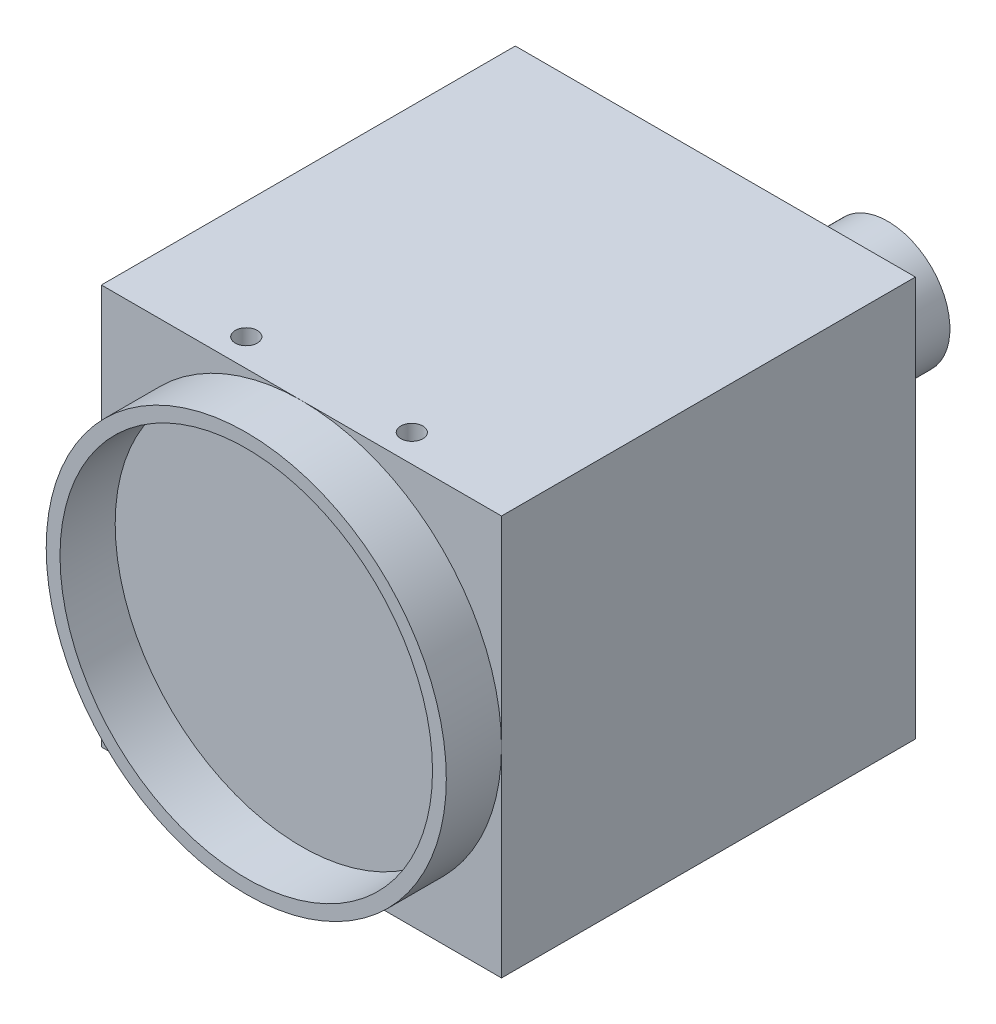
ISO-10303-21;
HEADER;
FILE_DESCRIPTION(('STEP AP214'),'2;1');
FILE_NAME('part.step','',(''),(''),'','','');
FILE_SCHEMA(('AUTOMOTIVE_DESIGN { 1 0 10303 214 1 1 1 1 }'));
ENDSEC;
DATA;
#1=APPLICATION_CONTEXT('core data for automotive mechanical design processes');
#2=APPLICATION_PROTOCOL_DEFINITION('international standard','automotive_design',2000,#1);
#3=PRODUCT_CONTEXT('',#1,'mechanical');
#4=PRODUCT('Part','Part','',(#3));
#5=PRODUCT_RELATED_PRODUCT_CATEGORY('part','',(#4));
#6=PRODUCT_DEFINITION_FORMATION('','',#4);
#7=PRODUCT_DEFINITION_CONTEXT('part definition',#1,'design');
#8=PRODUCT_DEFINITION('design','',#6,#7);
#9=PRODUCT_DEFINITION_SHAPE('','',#8);
#10=(LENGTH_UNIT() NAMED_UNIT(*) SI_UNIT(.MILLI.,.METRE.));
#11=(NAMED_UNIT(*) PLANE_ANGLE_UNIT() SI_UNIT($,.RADIAN.));
#12=(NAMED_UNIT(*) SI_UNIT($,.STERADIAN.) SOLID_ANGLE_UNIT());
#13=UNCERTAINTY_MEASURE_WITH_UNIT(LENGTH_MEASURE(1.E-05),#10,'distance_accuracy_value','');
#14=(GEOMETRIC_REPRESENTATION_CONTEXT(3) GLOBAL_UNCERTAINTY_ASSIGNED_CONTEXT((#13)) GLOBAL_UNIT_ASSIGNED_CONTEXT((#10,
#11,#12)) REPRESENTATION_CONTEXT('',''));
#15=CARTESIAN_POINT('',(0.,0.,0.));
#16=DIRECTION('',(0.,0.,1.));
#17=DIRECTION('',(1.,0.,0.));
#18=AXIS2_PLACEMENT_3D('',#15,#16,#17);
#19=CARTESIAN_POINT('',(0.,0.,30.));
#20=DIRECTION('',(0.,0.,-1.));
#21=DIRECTION('',(-1.,0.,0.));
#22=AXIS2_PLACEMENT_3D('',#19,#20,#21);
#23=PLANE('',#22);
#24=CARTESIAN_POINT('',(0.,0.,30.));
#25=DIRECTION('',(0.,0.,1.));
#26=DIRECTION('',(1.,0.,0.));
#27=AXIS2_PLACEMENT_3D('',#24,#25,#26);
#28=CIRCLE('',#27,14.5);
#29=CARTESIAN_POINT('',(14.5,0.,30.));
#30=VERTEX_POINT('',#29);
#31=CARTESIAN_POINT('',(0.,14.5,30.));
#32=VERTEX_POINT('',#31);
#33=EDGE_CURVE('E45',#30,#32,#28,.T.);
#34=ORIENTED_EDGE('',*,*,#33,.F.);
#35=DIRECTION('',(0.,1.,0.));
#36=VECTOR('',#35,1.);
#37=CARTESIAN_POINT('',(14.5,-14.5,30.));
#38=LINE('',#37,#36);
#39=CARTESIAN_POINT('',(14.5,14.5,30.));
#40=VERTEX_POINT('',#39);
#41=EDGE_CURVE('E147',#30,#40,#38,.T.);
#42=ORIENTED_EDGE('',*,*,#41,.T.);
#43=DIRECTION('',(-1.,0.,0.));
#44=VECTOR('',#43,1.);
#45=CARTESIAN_POINT('',(-14.5,14.5,30.));
#46=LINE('',#45,#44);
#47=EDGE_CURVE('E158',#40,#32,#46,.T.);
#48=ORIENTED_EDGE('',*,*,#47,.T.);
#49=EDGE_LOOP('',(#34,#42,#48));
#50=FACE_BOUND('',#49,.T.);
#51=ADVANCED_FACE('F34',(#50),#23,.F.);
#52=CARTESIAN_POINT('',(-14.5,0.,30.));
#53=VERTEX_POINT('',#52);
#54=EDGE_CURVE('E11',#32,#53,#28,.T.);
#55=ORIENTED_EDGE('',*,*,#54,.F.);
#56=CARTESIAN_POINT('',(-14.5,14.5,30.));
#57=VERTEX_POINT('',#56);
#58=EDGE_CURVE('E146',#32,#57,#46,.T.);
#59=ORIENTED_EDGE('',*,*,#58,.T.);
#60=DIRECTION('',(0.,-1.,0.));
#61=VECTOR('',#60,1.);
#62=CARTESIAN_POINT('',(-14.5,-14.5,30.));
#63=LINE('',#62,#61);
#64=EDGE_CURVE('E274',#57,#53,#63,.T.);
#65=ORIENTED_EDGE('',*,*,#64,.T.);
#66=EDGE_LOOP('',(#55,#59,#65));
#67=FACE_BOUND('',#66,.T.);
#68=ADVANCED_FACE('F306',(#67),#23,.F.);
#69=CARTESIAN_POINT('',(0.,-14.5,30.));
#70=VERTEX_POINT('',#69);
#71=EDGE_CURVE('E43',#53,#70,#28,.T.);
#72=ORIENTED_EDGE('',*,*,#71,.F.);
#73=CARTESIAN_POINT('',(-14.5,-14.5,30.));
#74=VERTEX_POINT('',#73);
#75=EDGE_CURVE('E273',#53,#74,#63,.T.);
#76=ORIENTED_EDGE('',*,*,#75,.T.);
#77=DIRECTION('',(1.,0.,0.));
#78=VECTOR('',#77,1.);
#79=CARTESIAN_POINT('',(-14.5,-14.5,30.));
#80=LINE('',#79,#78);
#81=EDGE_CURVE('E277',#74,#70,#80,.T.);
#82=ORIENTED_EDGE('',*,*,#81,.T.);
#83=EDGE_LOOP('',(#72,#76,#82));
#84=FACE_BOUND('',#83,.T.);
#85=ADVANCED_FACE('F315',(#84),#23,.F.);
#86=CARTESIAN_POINT('',(14.5,-14.5,30.));
#87=DIRECTION('',(-1.,0.,0.));
#88=DIRECTION('',(0.,0.,1.));
#89=AXIS2_PLACEMENT_3D('',#86,#87,#88);
#90=PLANE('',#89);
#91=DIRECTION('',(0.,1.,0.));
#92=VECTOR('',#91,1.);
#93=CARTESIAN_POINT('',(14.5,-14.5,0.));
#94=LINE('',#93,#92);
#95=CARTESIAN_POINT('',(14.5,-14.5,0.));
#96=VERTEX_POINT('',#95);
#97=CARTESIAN_POINT('',(14.5,14.5,0.));
#98=VERTEX_POINT('',#97);
#99=EDGE_CURVE('E270',#96,#98,#94,.T.);
#100=ORIENTED_EDGE('',*,*,#99,.T.);
#101=DIRECTION('',(0.,0.,-1.));
#102=VECTOR('',#101,1.);
#103=CARTESIAN_POINT('',(14.5,14.5,30.));
#104=LINE('',#103,#102);
#105=EDGE_CURVE('E38',#40,#98,#104,.T.);
#106=ORIENTED_EDGE('',*,*,#105,.F.);
#107=ORIENTED_EDGE('',*,*,#41,.F.);
#108=CARTESIAN_POINT('',(14.5,-14.5,30.));
#109=VERTEX_POINT('',#108);
#110=EDGE_CURVE('E139',#109,#30,#38,.T.);
#111=ORIENTED_EDGE('',*,*,#110,.F.);
#112=DIRECTION('',(0.,0.,-1.));
#113=VECTOR('',#112,1.);
#114=CARTESIAN_POINT('',(14.5,-14.5,30.));
#115=LINE('',#114,#113);
#116=EDGE_CURVE('E279',#109,#96,#115,.T.);
#117=ORIENTED_EDGE('',*,*,#116,.T.);
#118=EDGE_LOOP('',(#100,#106,#107,#111,#117));
#119=FACE_BOUND('',#118,.T.);
#120=ADVANCED_FACE('F36',(#119),#90,.F.);
#121=CARTESIAN_POINT('',(-14.5,14.5,30.));
#122=DIRECTION('',(0.,-1.,0.));
#123=DIRECTION('',(0.,0.,-1.));
#124=AXIS2_PLACEMENT_3D('',#121,#122,#123);
#125=PLANE('',#124);
#126=CARTESIAN_POINT('',(-5.99999999999999,14.5,28.));
#127=DIRECTION('',(0.,1.,0.));
#128=DIRECTION('',(0.,0.,1.));
#129=AXIS2_PLACEMENT_3D('',#126,#127,#128);
#130=CIRCLE('',#129,0.799999999999999);
#131=CARTESIAN_POINT('',(-5.99999999999999,14.5,28.8));
#132=VERTEX_POINT('',#131);
#133=EDGE_CURVE('E259',#132,#132,#130,.T.);
#134=ORIENTED_EDGE('',*,*,#133,.F.);
#135=EDGE_LOOP('',(#134));
#136=FACE_BOUND('',#135,.T.);
#137=CARTESIAN_POINT('',(5.99999999999999,14.5,28.));
#138=DIRECTION('',(0.,1.,0.));
#139=DIRECTION('',(0.,0.,1.));
#140=AXIS2_PLACEMENT_3D('',#137,#138,#139);
#141=CIRCLE('',#140,0.799999999999999);
#142=CARTESIAN_POINT('',(5.99999999999999,14.5,28.8));
#143=VERTEX_POINT('',#142);
#144=EDGE_CURVE('E265',#143,#143,#141,.T.);
#145=ORIENTED_EDGE('',*,*,#144,.F.);
#146=EDGE_LOOP('',(#145));
#147=FACE_BOUND('',#146,.T.);
#148=DIRECTION('',(-1.,0.,0.));
#149=VECTOR('',#148,1.);
#150=CARTESIAN_POINT('',(-14.5,14.5,0.));
#151=LINE('',#150,#149);
#152=CARTESIAN_POINT('',(-14.5,14.5,0.));
#153=VERTEX_POINT('',#152);
#154=EDGE_CURVE('E281',#98,#153,#151,.T.);
#155=ORIENTED_EDGE('',*,*,#154,.T.);
#156=DIRECTION('',(0.,0.,-1.));
#157=VECTOR('',#156,1.);
#158=CARTESIAN_POINT('',(-14.5,14.5,30.));
#159=LINE('',#158,#157);
#160=EDGE_CURVE('E163',#57,#153,#159,.T.);
#161=ORIENTED_EDGE('',*,*,#160,.F.);
#162=ORIENTED_EDGE('',*,*,#58,.F.);
#163=ORIENTED_EDGE('',*,*,#47,.F.);
#164=ORIENTED_EDGE('',*,*,#105,.T.);
#165=EDGE_LOOP('',(#155,#161,#162,#163,#164));
#166=FACE_BOUND('',#165,.T.);
#167=ADVANCED_FACE('F307',(#136,#147,#166),#125,.F.);
#168=CARTESIAN_POINT('',(-14.5,-14.5,30.));
#169=DIRECTION('',(1.,0.,0.));
#170=DIRECTION('',(0.,0.,-1.));
#171=AXIS2_PLACEMENT_3D('',#168,#169,#170);
#172=PLANE('',#171);
#173=DIRECTION('',(0.,-1.,0.));
#174=VECTOR('',#173,1.);
#175=CARTESIAN_POINT('',(-14.5,-14.5,0.));
#176=LINE('',#175,#174);
#177=CARTESIAN_POINT('',(-14.5,-14.5,0.));
#178=VERTEX_POINT('',#177);
#179=EDGE_CURVE('E283',#153,#178,#176,.T.);
#180=ORIENTED_EDGE('',*,*,#179,.T.);
#181=DIRECTION('',(0.,0.,-1.));
#182=VECTOR('',#181,1.);
#183=CARTESIAN_POINT('',(-14.5,-14.5,30.));
#184=LINE('',#183,#182);
#185=EDGE_CURVE('E287',#74,#178,#184,.T.);
#186=ORIENTED_EDGE('',*,*,#185,.F.);
#187=ORIENTED_EDGE('',*,*,#75,.F.);
#188=ORIENTED_EDGE('',*,*,#64,.F.);
#189=ORIENTED_EDGE('',*,*,#160,.T.);
#190=EDGE_LOOP('',(#180,#186,#187,#188,#189));
#191=FACE_BOUND('',#190,.T.);
#192=ADVANCED_FACE('F294',(#191),#172,.F.);
#193=CARTESIAN_POINT('',(-14.5,-14.5,30.));
#194=DIRECTION('',(0.,1.,0.));
#195=DIRECTION('',(0.,0.,1.));
#196=AXIS2_PLACEMENT_3D('',#193,#194,#195);
#197=PLANE('',#196);
#198=CARTESIAN_POINT('',(6.,-14.5,3.3));
#199=DIRECTION('',(0.,-1.,0.));
#200=DIRECTION('',(0.,0.,-1.));
#201=AXIS2_PLACEMENT_3D('',#198,#199,#200);
#202=CIRCLE('',#201,0.79999999999999);
#203=CARTESIAN_POINT('',(6.,-14.5,2.50000000000001));
#204=VERTEX_POINT('',#203);
#205=EDGE_CURVE('E211',#204,#204,#202,.T.);
#206=ORIENTED_EDGE('',*,*,#205,.F.);
#207=EDGE_LOOP('',(#206));
#208=FACE_BOUND('',#207,.T.);
#209=CARTESIAN_POINT('',(-6.,-14.5,3.3));
#210=DIRECTION('',(0.,-1.,0.));
#211=DIRECTION('',(0.,0.,-1.));
#212=AXIS2_PLACEMENT_3D('',#209,#210,#211);
#213=CIRCLE('',#212,0.79999999999999);
#214=CARTESIAN_POINT('',(-6.,-14.5,2.50000000000001));
#215=VERTEX_POINT('',#214);
#216=EDGE_CURVE('E223',#215,#215,#213,.T.);
#217=ORIENTED_EDGE('',*,*,#216,.F.);
#218=EDGE_LOOP('',(#217));
#219=FACE_BOUND('',#218,.T.);
#220=CARTESIAN_POINT('',(5.99999999999999,-14.5,25.5));
#221=DIRECTION('',(0.,-1.,0.));
#222=DIRECTION('',(0.,0.,-1.));
#223=AXIS2_PLACEMENT_3D('',#220,#221,#222);
#224=CIRCLE('',#223,0.799999999999999);
#225=CARTESIAN_POINT('',(5.99999999999999,-14.5,24.7));
#226=VERTEX_POINT('',#225);
#227=EDGE_CURVE('E229',#226,#226,#224,.T.);
#228=ORIENTED_EDGE('',*,*,#227,.F.);
#229=EDGE_LOOP('',(#228));
#230=FACE_BOUND('',#229,.T.);
#231=CARTESIAN_POINT('',(-5.99999999999999,-14.5,25.5));
#232=DIRECTION('',(0.,-1.,0.));
#233=DIRECTION('',(0.,0.,-1.));
#234=AXIS2_PLACEMENT_3D('',#231,#232,#233);
#235=CIRCLE('',#234,0.799999999999999);
#236=CARTESIAN_POINT('',(-5.99999999999999,-14.5,24.7));
#237=VERTEX_POINT('',#236);
#238=EDGE_CURVE('E235',#237,#237,#235,.T.);
#239=ORIENTED_EDGE('',*,*,#238,.F.);
#240=EDGE_LOOP('',(#239));
#241=FACE_BOUND('',#240,.T.);
#242=CARTESIAN_POINT('',(0.,-14.5,3.3));
#243=DIRECTION('',(0.,-1.,0.));
#244=DIRECTION('',(0.,0.,-1.));
#245=AXIS2_PLACEMENT_3D('',#242,#243,#244);
#246=CIRCLE('',#245,1.24999999999999);
#247=CARTESIAN_POINT('',(0.,-14.5,2.05000000000001));
#248=VERTEX_POINT('',#247);
#249=EDGE_CURVE('E241',#248,#248,#246,.T.);
#250=ORIENTED_EDGE('',*,*,#249,.F.);
#251=EDGE_LOOP('',(#250));
#252=FACE_BOUND('',#251,.T.);
#253=CARTESIAN_POINT('',(10.,-14.5,27.));
#254=DIRECTION('',(0.,-1.,0.));
#255=DIRECTION('',(0.,0.,-1.));
#256=AXIS2_PLACEMENT_3D('',#253,#254,#255);
#257=CIRCLE('',#256,1.25);
#258=CARTESIAN_POINT('',(10.,-14.5,25.75));
#259=VERTEX_POINT('',#258);
#260=EDGE_CURVE('E247',#259,#259,#257,.T.);
#261=ORIENTED_EDGE('',*,*,#260,.F.);
#262=EDGE_LOOP('',(#261));
#263=FACE_BOUND('',#262,.T.);
#264=CARTESIAN_POINT('',(-10.,-14.5,27.));
#265=DIRECTION('',(0.,-1.,0.));
#266=DIRECTION('',(0.,0.,-1.));
#267=AXIS2_PLACEMENT_3D('',#264,#265,#266);
#268=CIRCLE('',#267,1.25);
#269=CARTESIAN_POINT('',(-10.,-14.5,25.75));
#270=VERTEX_POINT('',#269);
#271=EDGE_CURVE('E253',#270,#270,#268,.T.);
#272=ORIENTED_EDGE('',*,*,#271,.F.);
#273=EDGE_LOOP('',(#272));
#274=FACE_BOUND('',#273,.T.);
#275=DIRECTION('',(1.,0.,0.));
#276=VECTOR('',#275,1.);
#277=CARTESIAN_POINT('',(-14.5,-14.5,0.));
#278=LINE('',#277,#276);
#279=EDGE_CURVE('E156',#178,#96,#278,.T.);
#280=ORIENTED_EDGE('',*,*,#279,.T.);
#281=ORIENTED_EDGE('',*,*,#116,.F.);
#282=EDGE_CURVE('E142',#70,#109,#80,.T.);
#283=ORIENTED_EDGE('',*,*,#282,.F.);
#284=ORIENTED_EDGE('',*,*,#81,.F.);
#285=ORIENTED_EDGE('',*,*,#185,.T.);
#286=EDGE_LOOP('',(#280,#281,#283,#284,#285));
#287=FACE_BOUND('',#286,.T.);
#288=ADVANCED_FACE('F303',(#208,#219,#230,#241,#252,#263,#274,#287),#197,.F.);
#289=EDGE_CURVE('E52',#70,#30,#28,.T.);
#290=ORIENTED_EDGE('',*,*,#289,.F.);
#291=ORIENTED_EDGE('',*,*,#282,.T.);
#292=ORIENTED_EDGE('',*,*,#110,.T.);
#293=EDGE_LOOP('',(#290,#291,#292));
#294=FACE_BOUND('',#293,.T.);
#295=ADVANCED_FACE('F141',(#294),#23,.F.);
#296=CARTESIAN_POINT('',(0.,0.,0.));
#297=DIRECTION('',(0.,0.,-1.));
#298=DIRECTION('',(-1.,0.,0.));
#299=AXIS2_PLACEMENT_3D('',#296,#297,#298);
#300=PLANE('',#299);
#301=CARTESIAN_POINT('',(8.50000000000001,8.5,0.));
#302=DIRECTION('',(0.,0.,-1.));
#303=DIRECTION('',(-1.,0.,0.));
#304=AXIS2_PLACEMENT_3D('',#301,#302,#303);
#305=CIRCLE('',#304,4.5);
#306=CARTESIAN_POINT('',(4.00000000000001,8.5,0.));
#307=VERTEX_POINT('',#306);
#308=EDGE_CURVE('E171',#307,#307,#305,.T.);
#309=ORIENTED_EDGE('',*,*,#308,.F.);
#310=EDGE_LOOP('',(#309));
#311=FACE_BOUND('',#310,.T.);
#312=CARTESIAN_POINT('',(-6.5,-10.0002765308904,0.));
#313=DIRECTION('',(0.,0.,-1.));
#314=DIRECTION('',(-1.,0.,0.));
#315=AXIS2_PLACEMENT_3D('',#312,#313,#314);
#316=CIRCLE('',#315,1.00027653089044);
#317=CARTESIAN_POINT('',(-7.50027653089044,-10.0002765308904,0.));
#318=VERTEX_POINT('',#317);
#319=EDGE_CURVE('E178',#318,#318,#316,.T.);
#320=ORIENTED_EDGE('',*,*,#319,.F.);
#321=EDGE_LOOP('',(#320));
#322=FACE_BOUND('',#321,.T.);
#323=CARTESIAN_POINT('',(6.5,-10.,0.));
#324=DIRECTION('',(0.,0.,-1.));
#325=DIRECTION('',(-1.,0.,0.));
#326=AXIS2_PLACEMENT_3D('',#323,#324,#325);
#327=CIRCLE('',#326,1.);
#328=CARTESIAN_POINT('',(5.5,-10.,0.));
#329=VERTEX_POINT('',#328);
#330=EDGE_CURVE('E170',#329,#329,#327,.T.);
#331=ORIENTED_EDGE('',*,*,#330,.F.);
#332=EDGE_LOOP('',(#331));
#333=FACE_BOUND('',#332,.T.);
#334=DIRECTION('',(0.,1.,0.));
#335=VECTOR('',#334,1.);
#336=CARTESIAN_POINT('',(-5.,-11.,0.));
#337=LINE('',#336,#335);
#338=CARTESIAN_POINT('',(-5.,-11.,0.));
#339=VERTEX_POINT('',#338);
#340=CARTESIAN_POINT('',(-5.,-9.,0.));
#341=VERTEX_POINT('',#340);
#342=EDGE_CURVE('E177',#339,#341,#337,.T.);
#343=ORIENTED_EDGE('',*,*,#342,.F.);
#344=DIRECTION('',(-1.,0.,0.));
#345=VECTOR('',#344,1.);
#346=CARTESIAN_POINT('',(5.,-11.,0.));
#347=LINE('',#346,#345);
#348=CARTESIAN_POINT('',(5.,-11.,0.));
#349=VERTEX_POINT('',#348);
#350=EDGE_CURVE('E190',#349,#339,#347,.T.);
#351=ORIENTED_EDGE('',*,*,#350,.F.);
#352=DIRECTION('',(0.,-1.,0.));
#353=VECTOR('',#352,1.);
#354=CARTESIAN_POINT('',(5.,-11.,0.));
#355=LINE('',#354,#353);
#356=CARTESIAN_POINT('',(5.,-9.,0.));
#357=VERTEX_POINT('',#356);
#358=EDGE_CURVE('E204',#357,#349,#355,.T.);
#359=ORIENTED_EDGE('',*,*,#358,.F.);
#360=DIRECTION('',(1.,0.,0.));
#361=VECTOR('',#360,1.);
#362=CARTESIAN_POINT('',(5.,-9.,0.));
#363=LINE('',#362,#361);
#364=EDGE_CURVE('E201',#341,#357,#363,.T.);
#365=ORIENTED_EDGE('',*,*,#364,.F.);
#366=EDGE_LOOP('',(#343,#351,#359,#365));
#367=FACE_BOUND('',#366,.T.);
#368=ORIENTED_EDGE('',*,*,#99,.F.);
#369=ORIENTED_EDGE('',*,*,#279,.F.);
#370=ORIENTED_EDGE('',*,*,#179,.F.);
#371=ORIENTED_EDGE('',*,*,#154,.F.);
#372=EDGE_LOOP('',(#368,#369,#370,#371));
#373=FACE_BOUND('',#372,.T.);
#374=ADVANCED_FACE('F301',(#311,#322,#333,#367,#373),#300,.T.);
#375=CARTESIAN_POINT('',(5.99999999999999,12.,28.));
#376=DIRECTION('',(0.,1.,0.));
#377=DIRECTION('',(0.,0.,1.));
#378=AXIS2_PLACEMENT_3D('',#375,#376,#377);
#379=CONICAL_SURFACE('',#378,0.799999999999999,1.02974425867665);
#380=CARTESIAN_POINT('',(5.99999999999999,11.519311504778,28.));
#381=VERTEX_POINT('',#380);
#382=VERTEX_LOOP('',#381);
#383=FACE_BOUND('',#382,.T.);
#384=CARTESIAN_POINT('',(5.99999999999999,12.,28.));
#385=DIRECTION('',(0.,1.,0.));
#386=DIRECTION('',(0.,0.,1.));
#387=AXIS2_PLACEMENT_3D('',#384,#385,#386);
#388=CIRCLE('',#387,0.799999999999999);
#389=CARTESIAN_POINT('',(5.99999999999999,12.,28.8));
#390=VERTEX_POINT('',#389);
#391=EDGE_CURVE('E268',#390,#390,#388,.T.);
#392=ORIENTED_EDGE('',*,*,#391,.T.);
#393=EDGE_LOOP('',(#392));
#394=FACE_BOUND('',#393,.T.);
#395=ADVANCED_FACE('F331',(#383,#394),#379,.F.);
#396=CARTESIAN_POINT('',(5.99999999999999,14.5,28.));
#397=DIRECTION('',(0.,1.,0.));
#398=DIRECTION('',(0.,0.,1.));
#399=AXIS2_PLACEMENT_3D('',#396,#397,#398);
#400=CYLINDRICAL_SURFACE('',#399,0.799999999999999);
#401=ORIENTED_EDGE('',*,*,#391,.F.);
#402=EDGE_LOOP('',(#401));
#403=FACE_BOUND('',#402,.T.);
#404=ORIENTED_EDGE('',*,*,#144,.T.);
#405=EDGE_LOOP('',(#404));
#406=FACE_BOUND('',#405,.T.);
#407=ADVANCED_FACE('F699',(#403,#406),#400,.F.);
#408=CARTESIAN_POINT('',(-5.99999999999999,12.,28.));
#409=DIRECTION('',(0.,1.,0.));
#410=DIRECTION('',(0.,0.,1.));
#411=AXIS2_PLACEMENT_3D('',#408,#409,#410);
#412=CONICAL_SURFACE('',#411,0.799999999999999,1.02974425867665);
#413=CARTESIAN_POINT('',(-6.,11.519311504778,28.));
#414=VERTEX_POINT('',#413);
#415=VERTEX_LOOP('',#414);
#416=FACE_BOUND('',#415,.T.);
#417=CARTESIAN_POINT('',(-5.99999999999999,12.,28.));
#418=DIRECTION('',(0.,1.,0.));
#419=DIRECTION('',(0.,0.,1.));
#420=AXIS2_PLACEMENT_3D('',#417,#418,#419);
#421=CIRCLE('',#420,0.799999999999999);
#422=CARTESIAN_POINT('',(-5.99999999999999,12.,28.8));
#423=VERTEX_POINT('',#422);
#424=EDGE_CURVE('E262',#423,#423,#421,.T.);
#425=ORIENTED_EDGE('',*,*,#424,.T.);
#426=EDGE_LOOP('',(#425));
#427=FACE_BOUND('',#426,.T.);
#428=ADVANCED_FACE('F689',(#416,#427),#412,.F.);
#429=CARTESIAN_POINT('',(-5.99999999999999,14.5,28.));
#430=DIRECTION('',(0.,1.,0.));
#431=DIRECTION('',(0.,0.,1.));
#432=AXIS2_PLACEMENT_3D('',#429,#430,#431);
#433=CYLINDRICAL_SURFACE('',#432,0.799999999999999);
#434=ORIENTED_EDGE('',*,*,#424,.F.);
#435=EDGE_LOOP('',(#434));
#436=FACE_BOUND('',#435,.T.);
#437=ORIENTED_EDGE('',*,*,#133,.T.);
#438=EDGE_LOOP('',(#437));
#439=FACE_BOUND('',#438,.T.);
#440=ADVANCED_FACE('F678',(#436,#439),#433,.F.);
#441=CARTESIAN_POINT('',(-10.,-11.7,27.));
#442=DIRECTION('',(0.,-1.,0.));
#443=DIRECTION('',(0.,0.,-1.));
#444=AXIS2_PLACEMENT_3D('',#441,#442,#443);
#445=CONICAL_SURFACE('',#444,1.25,1.02974425867665);
#446=CARTESIAN_POINT('',(-10.,-10.9489242262155,27.));
#447=VERTEX_POINT('',#446);
#448=VERTEX_LOOP('',#447);
#449=FACE_BOUND('',#448,.T.);
#450=CARTESIAN_POINT('',(-10.,-11.7,27.));
#451=DIRECTION('',(0.,-1.,0.));
#452=DIRECTION('',(0.,0.,-1.));
#453=AXIS2_PLACEMENT_3D('',#450,#451,#452);
#454=CIRCLE('',#453,1.25);
#455=CARTESIAN_POINT('',(-10.,-11.7,25.75));
#456=VERTEX_POINT('',#455);
#457=EDGE_CURVE('E256',#456,#456,#454,.T.);
#458=ORIENTED_EDGE('',*,*,#457,.T.);
#459=EDGE_LOOP('',(#458));
#460=FACE_BOUND('',#459,.T.);
#461=ADVANCED_FACE('F667',(#449,#460),#445,.F.);
#462=CARTESIAN_POINT('',(-10.,-14.5,27.));
#463=DIRECTION('',(0.,-1.,0.));
#464=DIRECTION('',(0.,0.,-1.));
#465=AXIS2_PLACEMENT_3D('',#462,#463,#464);
#466=CYLINDRICAL_SURFACE('',#465,1.25);
#467=ORIENTED_EDGE('',*,*,#457,.F.);
#468=EDGE_LOOP('',(#467));
#469=FACE_BOUND('',#468,.T.);
#470=ORIENTED_EDGE('',*,*,#271,.T.);
#471=EDGE_LOOP('',(#470));
#472=FACE_BOUND('',#471,.T.);
#473=ADVANCED_FACE('F657',(#469,#472),#466,.F.);
#474=CARTESIAN_POINT('',(10.,-11.7,27.));
#475=DIRECTION('',(0.,-1.,0.));
#476=DIRECTION('',(0.,0.,-1.));
#477=AXIS2_PLACEMENT_3D('',#474,#475,#476);
#478=CONICAL_SURFACE('',#477,1.25,1.02974425867665);
#479=CARTESIAN_POINT('',(10.,-10.9489242262155,27.));
#480=VERTEX_POINT('',#479);
#481=VERTEX_LOOP('',#480);
#482=FACE_BOUND('',#481,.T.);
#483=CARTESIAN_POINT('',(10.,-11.7,27.));
#484=DIRECTION('',(0.,-1.,0.));
#485=DIRECTION('',(0.,0.,-1.));
#486=AXIS2_PLACEMENT_3D('',#483,#484,#485);
#487=CIRCLE('',#486,1.25);
#488=CARTESIAN_POINT('',(10.,-11.7,25.75));
#489=VERTEX_POINT('',#488);
#490=EDGE_CURVE('E250',#489,#489,#487,.T.);
#491=ORIENTED_EDGE('',*,*,#490,.T.);
#492=EDGE_LOOP('',(#491));
#493=FACE_BOUND('',#492,.T.);
#494=ADVANCED_FACE('F646',(#482,#493),#478,.F.);
#495=CARTESIAN_POINT('',(10.,-14.5,27.));
#496=DIRECTION('',(0.,-1.,0.));
#497=DIRECTION('',(0.,0.,-1.));
#498=AXIS2_PLACEMENT_3D('',#495,#496,#497);
#499=CYLINDRICAL_SURFACE('',#498,1.25);
#500=ORIENTED_EDGE('',*,*,#490,.F.);
#501=EDGE_LOOP('',(#500));
#502=FACE_BOUND('',#501,.T.);
#503=ORIENTED_EDGE('',*,*,#260,.T.);
#504=EDGE_LOOP('',(#503));
#505=FACE_BOUND('',#504,.T.);
#506=ADVANCED_FACE('F636',(#502,#505),#499,.F.);
#507=CARTESIAN_POINT('',(0.,-12.,3.3));
#508=DIRECTION('',(0.,-1.,0.));
#509=DIRECTION('',(0.,0.,-1.));
#510=AXIS2_PLACEMENT_3D('',#507,#508,#509);
#511=CONICAL_SURFACE('',#510,1.25,1.02974425867665);
#512=CARTESIAN_POINT('',(0.,-11.2489242262155,3.3));
#513=VERTEX_POINT('',#512);
#514=VERTEX_LOOP('',#513);
#515=FACE_BOUND('',#514,.T.);
#516=CARTESIAN_POINT('',(0.,-12.,3.3));
#517=DIRECTION('',(0.,-1.,0.));
#518=DIRECTION('',(0.,0.,-1.));
#519=AXIS2_PLACEMENT_3D('',#516,#517,#518);
#520=CIRCLE('',#519,1.25);
#521=CARTESIAN_POINT('',(0.,-12.,2.05));
#522=VERTEX_POINT('',#521);
#523=EDGE_CURVE('E244',#522,#522,#520,.T.);
#524=ORIENTED_EDGE('',*,*,#523,.T.);
#525=EDGE_LOOP('',(#524));
#526=FACE_BOUND('',#525,.T.);
#527=ADVANCED_FACE('F625',(#515,#526),#511,.F.);
#528=CARTESIAN_POINT('',(0.,-14.5,3.3));
#529=DIRECTION('',(0.,-1.,0.));
#530=DIRECTION('',(0.,0.,-1.));
#531=AXIS2_PLACEMENT_3D('',#528,#529,#530);
#532=CYLINDRICAL_SURFACE('',#531,1.24999999999999);
#533=ORIENTED_EDGE('',*,*,#523,.F.);
#534=EDGE_LOOP('',(#533));
#535=FACE_BOUND('',#534,.T.);
#536=ORIENTED_EDGE('',*,*,#249,.T.);
#537=EDGE_LOOP('',(#536));
#538=FACE_BOUND('',#537,.T.);
#539=ADVANCED_FACE('F615',(#535,#538),#532,.F.);
#540=CARTESIAN_POINT('',(-5.99999999999999,-12.,25.5));
#541=DIRECTION('',(0.,-1.,0.));
#542=DIRECTION('',(0.,0.,-1.));
#543=AXIS2_PLACEMENT_3D('',#540,#541,#542);
#544=CONICAL_SURFACE('',#543,0.799999999999999,1.02974425867665);
#545=CARTESIAN_POINT('',(-6.,-11.519311504778,25.5));
#546=VERTEX_POINT('',#545);
#547=VERTEX_LOOP('',#546);
#548=FACE_BOUND('',#547,.T.);
#549=CARTESIAN_POINT('',(-5.99999999999999,-12.,25.5));
#550=DIRECTION('',(0.,-1.,0.));
#551=DIRECTION('',(0.,0.,-1.));
#552=AXIS2_PLACEMENT_3D('',#549,#550,#551);
#553=CIRCLE('',#552,0.799999999999999);
#554=CARTESIAN_POINT('',(-5.99999999999999,-12.,24.7));
#555=VERTEX_POINT('',#554);
#556=EDGE_CURVE('E238',#555,#555,#553,.T.);
#557=ORIENTED_EDGE('',*,*,#556,.T.);
#558=EDGE_LOOP('',(#557));
#559=FACE_BOUND('',#558,.T.);
#560=ADVANCED_FACE('F604',(#548,#559),#544,.F.);
#561=CARTESIAN_POINT('',(-5.99999999999999,-14.5,25.5));
#562=DIRECTION('',(0.,-1.,0.));
#563=DIRECTION('',(0.,0.,-1.));
#564=AXIS2_PLACEMENT_3D('',#561,#562,#563);
#565=CYLINDRICAL_SURFACE('',#564,0.799999999999999);
#566=ORIENTED_EDGE('',*,*,#556,.F.);
#567=EDGE_LOOP('',(#566));
#568=FACE_BOUND('',#567,.T.);
#569=ORIENTED_EDGE('',*,*,#238,.T.);
#570=EDGE_LOOP('',(#569));
#571=FACE_BOUND('',#570,.T.);
#572=ADVANCED_FACE('F594',(#568,#571),#565,.F.);
#573=CARTESIAN_POINT('',(5.99999999999999,-12.,25.5));
#574=DIRECTION('',(0.,-1.,0.));
#575=DIRECTION('',(0.,0.,-1.));
#576=AXIS2_PLACEMENT_3D('',#573,#574,#575);
#577=CONICAL_SURFACE('',#576,0.799999999999999,1.02974425867665);
#578=CARTESIAN_POINT('',(5.99999999999999,-11.519311504778,25.5));
#579=VERTEX_POINT('',#578);
#580=VERTEX_LOOP('',#579);
#581=FACE_BOUND('',#580,.T.);
#582=CARTESIAN_POINT('',(5.99999999999999,-12.,25.5));
#583=DIRECTION('',(0.,-1.,0.));
#584=DIRECTION('',(0.,0.,-1.));
#585=AXIS2_PLACEMENT_3D('',#582,#583,#584);
#586=CIRCLE('',#585,0.799999999999999);
#587=CARTESIAN_POINT('',(5.99999999999999,-12.,24.7));
#588=VERTEX_POINT('',#587);
#589=EDGE_CURVE('E232',#588,#588,#586,.T.);
#590=ORIENTED_EDGE('',*,*,#589,.T.);
#591=EDGE_LOOP('',(#590));
#592=FACE_BOUND('',#591,.T.);
#593=ADVANCED_FACE('F583',(#581,#592),#577,.F.);
#594=CARTESIAN_POINT('',(5.99999999999999,-14.5,25.5));
#595=DIRECTION('',(0.,-1.,0.));
#596=DIRECTION('',(0.,0.,-1.));
#597=AXIS2_PLACEMENT_3D('',#594,#595,#596);
#598=CYLINDRICAL_SURFACE('',#597,0.799999999999999);
#599=ORIENTED_EDGE('',*,*,#589,.F.);
#600=EDGE_LOOP('',(#599));
#601=FACE_BOUND('',#600,.T.);
#602=ORIENTED_EDGE('',*,*,#227,.T.);
#603=EDGE_LOOP('',(#602));
#604=FACE_BOUND('',#603,.T.);
#605=ADVANCED_FACE('F573',(#601,#604),#598,.F.);
#606=CARTESIAN_POINT('',(-6.,-12.5,3.3));
#607=DIRECTION('',(0.,-1.,0.));
#608=DIRECTION('',(0.,0.,-1.));
#609=AXIS2_PLACEMENT_3D('',#606,#607,#608);
#610=CONICAL_SURFACE('',#609,0.799999999999999,1.02974425867665);
#611=CARTESIAN_POINT('',(-6.,-12.019311504778,3.3));
#612=VERTEX_POINT('',#611);
#613=VERTEX_LOOP('',#612);
#614=FACE_BOUND('',#613,.T.);
#615=CARTESIAN_POINT('',(-6.,-12.5,3.3));
#616=DIRECTION('',(0.,-1.,0.));
#617=DIRECTION('',(0.,0.,-1.));
#618=AXIS2_PLACEMENT_3D('',#615,#616,#617);
#619=CIRCLE('',#618,0.799999999999999);
#620=CARTESIAN_POINT('',(-6.,-12.5,2.5));
#621=VERTEX_POINT('',#620);
#622=EDGE_CURVE('E226',#621,#621,#619,.T.);
#623=ORIENTED_EDGE('',*,*,#622,.T.);
#624=EDGE_LOOP('',(#623));
#625=FACE_BOUND('',#624,.T.);
#626=ADVANCED_FACE('F562',(#614,#625),#610,.F.);
#627=CARTESIAN_POINT('',(-6.,-14.5,3.3));
#628=DIRECTION('',(0.,-1.,0.));
#629=DIRECTION('',(0.,0.,-1.));
#630=AXIS2_PLACEMENT_3D('',#627,#628,#629);
#631=CYLINDRICAL_SURFACE('',#630,0.799999999999995);
#632=ORIENTED_EDGE('',*,*,#622,.F.);
#633=EDGE_LOOP('',(#632));
#634=FACE_BOUND('',#633,.T.);
#635=ORIENTED_EDGE('',*,*,#216,.T.);
#636=EDGE_LOOP('',(#635));
#637=FACE_BOUND('',#636,.T.);
#638=ADVANCED_FACE('F552',(#634,#637),#631,.F.);
#639=CARTESIAN_POINT('',(6.,-12.5,3.3));
#640=DIRECTION('',(0.,-1.,0.));
#641=DIRECTION('',(0.,0.,-1.));
#642=AXIS2_PLACEMENT_3D('',#639,#640,#641);
#643=CONICAL_SURFACE('',#642,0.799999999999999,1.02974425867665);
#644=CARTESIAN_POINT('',(6.,-12.019311504778,3.3));
#645=VERTEX_POINT('',#644);
#646=VERTEX_LOOP('',#645);
#647=FACE_BOUND('',#646,.T.);
#648=CARTESIAN_POINT('',(6.,-12.5,3.3));
#649=DIRECTION('',(0.,-1.,0.));
#650=DIRECTION('',(0.,0.,-1.));
#651=AXIS2_PLACEMENT_3D('',#648,#649,#650);
#652=CIRCLE('',#651,0.799999999999999);
#653=CARTESIAN_POINT('',(6.,-12.5,2.5));
#654=VERTEX_POINT('',#653);
#655=EDGE_CURVE('E220',#654,#654,#652,.T.);
#656=ORIENTED_EDGE('',*,*,#655,.T.);
#657=EDGE_LOOP('',(#656));
#658=FACE_BOUND('',#657,.T.);
#659=ADVANCED_FACE('F541',(#647,#658),#643,.F.);
#660=CARTESIAN_POINT('',(6.,-14.5,3.3));
#661=DIRECTION('',(0.,-1.,0.));
#662=DIRECTION('',(0.,0.,-1.));
#663=AXIS2_PLACEMENT_3D('',#660,#661,#662);
#664=CYLINDRICAL_SURFACE('',#663,0.799999999999995);
#665=ORIENTED_EDGE('',*,*,#655,.F.);
#666=EDGE_LOOP('',(#665));
#667=FACE_BOUND('',#666,.T.);
#668=ORIENTED_EDGE('',*,*,#205,.T.);
#669=EDGE_LOOP('',(#668));
#670=FACE_BOUND('',#669,.T.);
#671=ADVANCED_FACE('F530',(#667,#670),#664,.F.);
#672=CARTESIAN_POINT('',(-5.,-11.,3.));
#673=DIRECTION('',(-1.,0.,0.));
#674=DIRECTION('',(0.,0.,1.));
#675=AXIS2_PLACEMENT_3D('',#672,#673,#674);
#676=PLANE('',#675);
#677=ORIENTED_EDGE('',*,*,#342,.T.);
#678=DIRECTION('',(0.,0.,-1.));
#679=VECTOR('',#678,1.);
#680=CARTESIAN_POINT('',(-5.,-9.,3.));
#681=LINE('',#680,#679);
#682=CARTESIAN_POINT('',(-5.,-9.,3.));
#683=VERTEX_POINT('',#682);
#684=EDGE_CURVE('E199',#683,#341,#681,.T.);
#685=ORIENTED_EDGE('',*,*,#684,.F.);
#686=DIRECTION('',(0.,1.,0.));
#687=VECTOR('',#686,1.);
#688=CARTESIAN_POINT('',(-5.,-11.,3.));
#689=LINE('',#688,#687);
#690=CARTESIAN_POINT('',(-5.,-11.,3.));
#691=VERTEX_POINT('',#690);
#692=EDGE_CURVE('E186',#691,#683,#689,.T.);
#693=ORIENTED_EDGE('',*,*,#692,.F.);
#694=DIRECTION('',(0.,0.,-1.));
#695=VECTOR('',#694,1.);
#696=CARTESIAN_POINT('',(-5.,-11.,3.));
#697=LINE('',#696,#695);
#698=EDGE_CURVE('E209',#691,#339,#697,.T.);
#699=ORIENTED_EDGE('',*,*,#698,.T.);
#700=EDGE_LOOP('',(#677,#685,#693,#699));
#701=FACE_BOUND('',#700,.T.);
#702=ADVANCED_FACE('F520',(#701),#676,.F.);
#703=CARTESIAN_POINT('',(5.,-11.,3.));
#704=DIRECTION('',(0.,-1.,0.));
#705=DIRECTION('',(0.,0.,-1.));
#706=AXIS2_PLACEMENT_3D('',#703,#704,#705);
#707=PLANE('',#706);
#708=ORIENTED_EDGE('',*,*,#350,.T.);
#709=ORIENTED_EDGE('',*,*,#698,.F.);
#710=DIRECTION('',(-1.,0.,0.));
#711=VECTOR('',#710,1.);
#712=CARTESIAN_POINT('',(5.,-11.,3.));
#713=LINE('',#712,#711);
#714=CARTESIAN_POINT('',(5.,-11.,3.));
#715=VERTEX_POINT('',#714);
#716=EDGE_CURVE('E196',#715,#691,#713,.T.);
#717=ORIENTED_EDGE('',*,*,#716,.F.);
#718=DIRECTION('',(0.,0.,-1.));
#719=VECTOR('',#718,1.);
#720=CARTESIAN_POINT('',(5.,-11.,3.));
#721=LINE('',#720,#719);
#722=EDGE_CURVE('E212',#715,#349,#721,.T.);
#723=ORIENTED_EDGE('',*,*,#722,.T.);
#724=EDGE_LOOP('',(#708,#709,#717,#723));
#725=FACE_BOUND('',#724,.T.);
#726=ADVANCED_FACE('F510',(#725),#707,.F.);
#727=CARTESIAN_POINT('',(5.,-11.,3.));
#728=DIRECTION('',(1.,0.,0.));
#729=DIRECTION('',(0.,0.,-1.));
#730=AXIS2_PLACEMENT_3D('',#727,#728,#729);
#731=PLANE('',#730);
#732=ORIENTED_EDGE('',*,*,#358,.T.);
#733=ORIENTED_EDGE('',*,*,#722,.F.);
#734=DIRECTION('',(0.,-1.,0.));
#735=VECTOR('',#734,1.);
#736=CARTESIAN_POINT('',(5.,-11.,3.));
#737=LINE('',#736,#735);
#738=CARTESIAN_POINT('',(5.,-9.,3.));
#739=VERTEX_POINT('',#738);
#740=EDGE_CURVE('E193',#739,#715,#737,.T.);
#741=ORIENTED_EDGE('',*,*,#740,.F.);
#742=DIRECTION('',(0.,0.,-1.));
#743=VECTOR('',#742,1.);
#744=CARTESIAN_POINT('',(5.,-9.,3.));
#745=LINE('',#744,#743);
#746=EDGE_CURVE('E214',#739,#357,#745,.T.);
#747=ORIENTED_EDGE('',*,*,#746,.T.);
#748=EDGE_LOOP('',(#732,#733,#741,#747));
#749=FACE_BOUND('',#748,.T.);
#750=ADVANCED_FACE('F500',(#749),#731,.F.);
#751=CARTESIAN_POINT('',(5.,-9.,3.));
#752=DIRECTION('',(0.,1.,0.));
#753=DIRECTION('',(0.,0.,1.));
#754=AXIS2_PLACEMENT_3D('',#751,#752,#753);
#755=PLANE('',#754);
#756=ORIENTED_EDGE('',*,*,#364,.T.);
#757=ORIENTED_EDGE('',*,*,#746,.F.);
#758=DIRECTION('',(1.,0.,0.));
#759=VECTOR('',#758,1.);
#760=CARTESIAN_POINT('',(5.,-9.,3.));
#761=LINE('',#760,#759);
#762=EDGE_CURVE('E189',#683,#739,#761,.T.);
#763=ORIENTED_EDGE('',*,*,#762,.F.);
#764=ORIENTED_EDGE('',*,*,#684,.T.);
#765=EDGE_LOOP('',(#756,#757,#763,#764));
#766=FACE_BOUND('',#765,.T.);
#767=ADVANCED_FACE('F490',(#766),#755,.F.);
#768=CARTESIAN_POINT('',(0.,0.,3.));
#769=DIRECTION('',(0.,0.,1.));
#770=DIRECTION('',(1.,0.,0.));
#771=AXIS2_PLACEMENT_3D('',#768,#769,#770);
#772=PLANE('',#771);
#773=ORIENTED_EDGE('',*,*,#692,.T.);
#774=ORIENTED_EDGE('',*,*,#762,.T.);
#775=ORIENTED_EDGE('',*,*,#740,.T.);
#776=ORIENTED_EDGE('',*,*,#716,.T.);
#777=EDGE_LOOP('',(#773,#774,#775,#776));
#778=FACE_BOUND('',#777,.T.);
#779=ADVANCED_FACE('F480',(#778),#772,.F.);
#780=CARTESIAN_POINT('',(6.5,-10.,3.));
#781=DIRECTION('',(0.,0.,-1.));
#782=DIRECTION('',(-1.,0.,0.));
#783=AXIS2_PLACEMENT_3D('',#780,#781,#782);
#784=CYLINDRICAL_SURFACE('',#783,1.);
#785=CARTESIAN_POINT('',(6.5,-10.,3.));
#786=DIRECTION('',(0.,0.,-1.));
#787=DIRECTION('',(-1.,0.,0.));
#788=AXIS2_PLACEMENT_3D('',#785,#786,#787);
#789=CIRCLE('',#788,1.);
#790=CARTESIAN_POINT('',(5.5,-10.,3.));
#791=VERTEX_POINT('',#790);
#792=EDGE_CURVE('E181',#791,#791,#789,.T.);
#793=ORIENTED_EDGE('',*,*,#792,.F.);
#794=EDGE_LOOP('',(#793));
#795=FACE_BOUND('',#794,.T.);
#796=ORIENTED_EDGE('',*,*,#330,.T.);
#797=EDGE_LOOP('',(#796));
#798=FACE_BOUND('',#797,.T.);
#799=ADVANCED_FACE('F470',(#795,#798),#784,.F.);
#800=CARTESIAN_POINT('',(6.5,-10.,3.));
#801=DIRECTION('',(0.,0.,-1.));
#802=DIRECTION('',(-1.,0.,0.));
#803=AXIS2_PLACEMENT_3D('',#800,#801,#802);
#804=PLANE('',#803);
#805=ORIENTED_EDGE('',*,*,#792,.T.);
#806=EDGE_LOOP('',(#805));
#807=FACE_BOUND('',#806,.T.);
#808=ADVANCED_FACE('F460',(#807),#804,.T.);
#809=CARTESIAN_POINT('',(-6.5,-10.0002765308904,3.));
#810=DIRECTION('',(0.,0.,-1.));
#811=DIRECTION('',(-1.,0.,0.));
#812=AXIS2_PLACEMENT_3D('',#809,#810,#811);
#813=CYLINDRICAL_SURFACE('',#812,1.00027653089044);
#814=CARTESIAN_POINT('',(-6.5,-10.0002765308904,3.));
#815=DIRECTION('',(0.,0.,-1.));
#816=DIRECTION('',(-1.,0.,0.));
#817=AXIS2_PLACEMENT_3D('',#814,#815,#816);
#818=CIRCLE('',#817,1.00027653089044);
#819=CARTESIAN_POINT('',(-7.50027653089044,-10.0002765308904,3.));
#820=VERTEX_POINT('',#819);
#821=EDGE_CURVE('E174',#820,#820,#818,.T.);
#822=ORIENTED_EDGE('',*,*,#821,.F.);
#823=EDGE_LOOP('',(#822));
#824=FACE_BOUND('',#823,.T.);
#825=ORIENTED_EDGE('',*,*,#319,.T.);
#826=EDGE_LOOP('',(#825));
#827=FACE_BOUND('',#826,.T.);
#828=ADVANCED_FACE('F450',(#824,#827),#813,.F.);
#829=CARTESIAN_POINT('',(-6.5,-10.0002765308904,3.));
#830=DIRECTION('',(0.,0.,-1.));
#831=DIRECTION('',(-1.,0.,0.));
#832=AXIS2_PLACEMENT_3D('',#829,#830,#831);
#833=PLANE('',#832);
#834=ORIENTED_EDGE('',*,*,#821,.T.);
#835=EDGE_LOOP('',(#834));
#836=FACE_BOUND('',#835,.T.);
#837=ADVANCED_FACE('F433',(#836),#833,.T.);
#838=CARTESIAN_POINT('',(8.50000000000001,8.5,-4.));
#839=DIRECTION('',(0.,0.,1.));
#840=DIRECTION('',(1.,0.,0.));
#841=AXIS2_PLACEMENT_3D('',#838,#839,#840);
#842=CYLINDRICAL_SURFACE('',#841,4.5);
#843=CARTESIAN_POINT('',(8.50000000000001,8.5,-4.));
#844=DIRECTION('',(0.,0.,-1.));
#845=DIRECTION('',(-1.,0.,0.));
#846=AXIS2_PLACEMENT_3D('',#843,#844,#845);
#847=CIRCLE('',#846,4.5);
#848=CARTESIAN_POINT('',(4.00000000000001,8.5,-4.));
#849=VERTEX_POINT('',#848);
#850=EDGE_CURVE('E167',#849,#849,#847,.T.);
#851=ORIENTED_EDGE('',*,*,#850,.F.);
#852=EDGE_LOOP('',(#851));
#853=FACE_BOUND('',#852,.T.);
#854=ORIENTED_EDGE('',*,*,#308,.T.);
#855=EDGE_LOOP('',(#854));
#856=FACE_BOUND('',#855,.T.);
#857=ADVANCED_FACE('F426',(#853,#856),#842,.T.);
#858=CARTESIAN_POINT('',(8.50000000000001,8.5,-4.));
#859=DIRECTION('',(0.,0.,-1.));
#860=DIRECTION('',(-1.,0.,0.));
#861=AXIS2_PLACEMENT_3D('',#858,#859,#860);
#862=PLANE('',#861);
#863=ORIENTED_EDGE('',*,*,#850,.T.);
#864=EDGE_LOOP('',(#863));
#865=FACE_BOUND('',#864,.T.);
#866=ADVANCED_FACE('F384',(#865),#862,.T.);
#867=CARTESIAN_POINT('',(0.,0.,34.));
#868=DIRECTION('',(0.,0.,1.));
#869=DIRECTION('',(1.,0.,0.));
#870=AXIS2_PLACEMENT_3D('',#867,#868,#869);
#871=PLANE('',#870);
#872=CARTESIAN_POINT('',(0.,0.,34.));
#873=DIRECTION('',(0.,0.,1.));
#874=DIRECTION('',(1.,0.,0.));
#875=AXIS2_PLACEMENT_3D('',#872,#873,#874);
#876=CIRCLE('',#875,14.5);
#877=CARTESIAN_POINT('',(14.5,0.,34.));
#878=VERTEX_POINT('',#877);
#879=EDGE_CURVE('E160',#878,#878,#876,.T.);
#880=ORIENTED_EDGE('',*,*,#879,.T.);
#881=EDGE_LOOP('',(#880));
#882=FACE_BOUND('',#881,.T.);
#883=CARTESIAN_POINT('',(0.,0.,34.));
#884=DIRECTION('',(0.,0.,1.));
#885=DIRECTION('',(1.,0.,0.));
#886=AXIS2_PLACEMENT_3D('',#883,#884,#885);
#887=CIRCLE('',#886,13.5);
#888=CARTESIAN_POINT('',(13.5,0.,34.));
#889=VERTEX_POINT('',#888);
#890=EDGE_CURVE('E161',#889,#889,#887,.T.);
#891=ORIENTED_EDGE('',*,*,#890,.F.);
#892=EDGE_LOOP('',(#891));
#893=FACE_BOUND('',#892,.T.);
#894=ADVANCED_FACE('F379',(#882,#893),#871,.T.);
#895=CARTESIAN_POINT('',(0.,0.,34.));
#896=DIRECTION('',(0.,0.,-1.));
#897=DIRECTION('',(-1.,0.,0.));
#898=AXIS2_PLACEMENT_3D('',#895,#896,#897);
#899=CYLINDRICAL_SURFACE('',#898,14.5);
#900=ORIENTED_EDGE('',*,*,#879,.F.);
#901=EDGE_LOOP('',(#900));
#902=FACE_BOUND('',#901,.T.);
#903=ORIENTED_EDGE('',*,*,#33,.T.);
#904=ORIENTED_EDGE('',*,*,#54,.T.);
#905=ORIENTED_EDGE('',*,*,#71,.T.);
#906=ORIENTED_EDGE('',*,*,#289,.T.);
#907=EDGE_LOOP('',(#903,#904,#905,#906));
#908=FACE_BOUND('',#907,.T.);
#909=ADVANCED_FACE('F162',(#902,#908),#899,.T.);
#910=CARTESIAN_POINT('',(0.,0.,34.));
#911=DIRECTION('',(0.,0.,-1.));
#912=DIRECTION('',(-1.,0.,0.));
#913=AXIS2_PLACEMENT_3D('',#910,#911,#912);
#914=CYLINDRICAL_SURFACE('',#913,13.5);
#915=ORIENTED_EDGE('',*,*,#890,.T.);
#916=EDGE_LOOP('',(#915));
#917=FACE_BOUND('',#916,.T.);
#918=CARTESIAN_POINT('',(0.,0.,30.));
#919=DIRECTION('',(0.,0.,1.));
#920=DIRECTION('',(1.,0.,0.));
#921=AXIS2_PLACEMENT_3D('',#918,#919,#920);
#922=CIRCLE('',#921,13.5);
#923=CARTESIAN_POINT('',(13.5,0.,30.));
#924=VERTEX_POINT('',#923);
#925=EDGE_CURVE('E794',#924,#924,#922,.T.);
#926=ORIENTED_EDGE('',*,*,#925,.F.);
#927=EDGE_LOOP('',(#926));
#928=FACE_BOUND('',#927,.T.);
#929=ADVANCED_FACE('F336',(#917,#928),#914,.F.);
#930=ORIENTED_EDGE('',*,*,#925,.T.);
#931=EDGE_LOOP('',(#930));
#932=FACE_BOUND('',#931,.T.);
#933=ADVANCED_FACE('F326',(#932),#23,.F.);
#934=CLOSED_SHELL('',(#51,#68,#85,#120,#167,#192,#288,#295,#374,#395,#407,#428,#440,#461,#473,
#494,#506,#527,#539,#560,#572,#593,#605,#626,#638,#659,#671,#702,#726,#750,#767,#779,#799,#808,
#828,#837,#857,#866,#894,#909,#929,#933));
#935=MANIFOLD_SOLID_BREP('B2',#934);
#936=ADVANCED_BREP_SHAPE_REPRESENTATION('',(#18,#935),#14);
#937=SHAPE_DEFINITION_REPRESENTATION(#9,#936);
ENDSEC;
END-ISO-10303-21;
